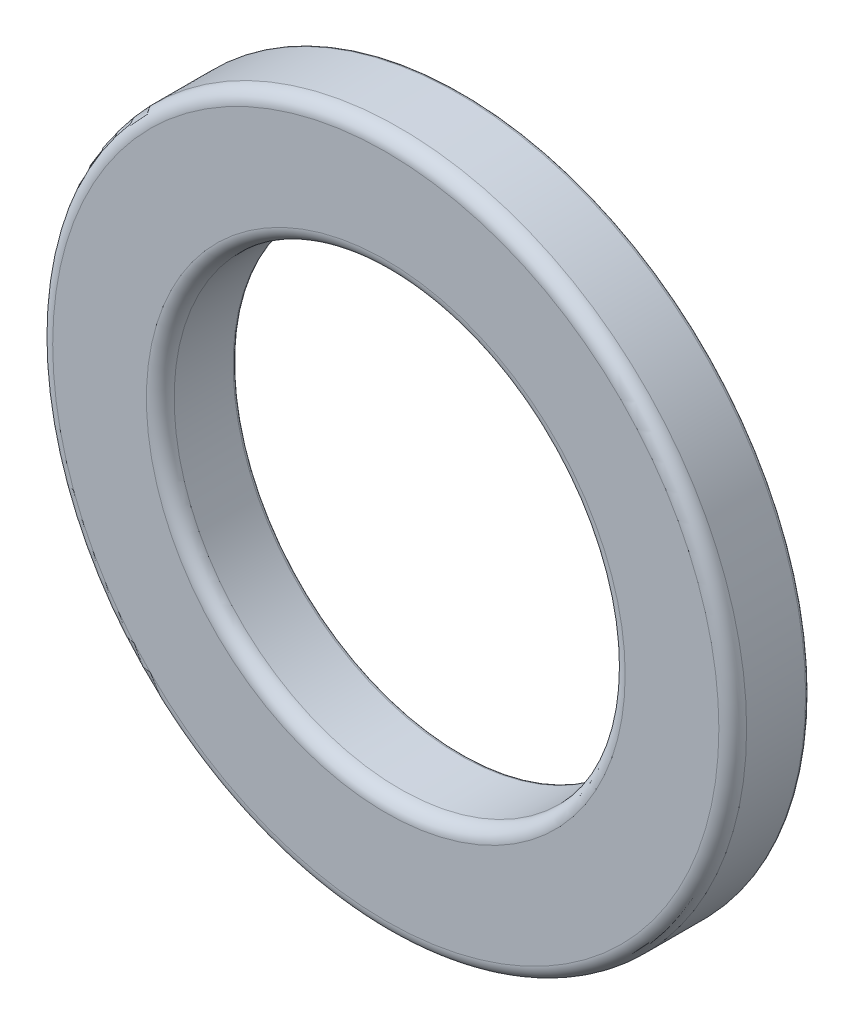
ISO-10303-21;
HEADER;
FILE_DESCRIPTION(('STEP AP214'),'2;1');
FILE_NAME('part.step','',(''),(''),'','','');
FILE_SCHEMA(('AUTOMOTIVE_DESIGN { 1 0 10303 214 1 1 1 1 }'));
ENDSEC;
DATA;
#1=APPLICATION_CONTEXT('core data for automotive mechanical design processes');
#2=APPLICATION_PROTOCOL_DEFINITION('international standard','automotive_design',2000,#1);
#3=PRODUCT_CONTEXT('',#1,'mechanical');
#4=PRODUCT('Part','Part','',(#3));
#5=PRODUCT_RELATED_PRODUCT_CATEGORY('part','',(#4));
#6=PRODUCT_DEFINITION_FORMATION('','',#4);
#7=PRODUCT_DEFINITION_CONTEXT('part definition',#1,'design');
#8=PRODUCT_DEFINITION('design','',#6,#7);
#9=PRODUCT_DEFINITION_SHAPE('','',#8);
#10=(LENGTH_UNIT() NAMED_UNIT(*) SI_UNIT(.MILLI.,.METRE.));
#11=(NAMED_UNIT(*) PLANE_ANGLE_UNIT() SI_UNIT($,.RADIAN.));
#12=(NAMED_UNIT(*) SI_UNIT($,.STERADIAN.) SOLID_ANGLE_UNIT());
#13=UNCERTAINTY_MEASURE_WITH_UNIT(LENGTH_MEASURE(1.E-05),#10,'distance_accuracy_value','');
#14=(GEOMETRIC_REPRESENTATION_CONTEXT(3) GLOBAL_UNCERTAINTY_ASSIGNED_CONTEXT((#13)) GLOBAL_UNIT_ASSIGNED_CONTEXT((#10,
#11,#12)) REPRESENTATION_CONTEXT('',''));
#15=CARTESIAN_POINT('',(0.,0.,0.));
#16=DIRECTION('',(0.,0.,1.));
#17=DIRECTION('',(1.,0.,0.));
#18=AXIS2_PLACEMENT_3D('',#15,#16,#17);
#19=CARTESIAN_POINT('',(0.,0.,-1.1));
#20=DIRECTION('',(0.,0.,1.));
#21=DIRECTION('',(1.,0.,0.));
#22=AXIS2_PLACEMENT_3D('',#19,#20,#21);
#23=CYLINDRICAL_SURFACE('',#22,10.);
#24=CARTESIAN_POINT('',(0.,0.,-1.));
#25=DIRECTION('',(0.,0.,1.));
#26=DIRECTION('',(1.,0.,0.));
#27=AXIS2_PLACEMENT_3D('',#24,#25,#26);
#28=CIRCLE('',#27,10.);
#29=CARTESIAN_POINT('',(10.,0.,-1.));
#30=VERTEX_POINT('',#29);
#31=EDGE_CURVE('E91',#30,#30,#28,.T.);
#32=ORIENTED_EDGE('',*,*,#31,.T.);
#33=EDGE_LOOP('',(#32));
#34=FACE_BOUND('',#33,.T.);
#35=CARTESIAN_POINT('',(0.,0.,0.7));
#36=DIRECTION('',(0.,0.,1.));
#37=DIRECTION('',(1.,0.,0.));
#38=AXIS2_PLACEMENT_3D('',#35,#36,#37);
#39=CIRCLE('',#38,10.);
#40=CARTESIAN_POINT('',(10.,0.,0.7));
#41=VERTEX_POINT('',#40);
#42=EDGE_CURVE('E99',#41,#41,#39,.F.);
#43=ORIENTED_EDGE('',*,*,#42,.T.);
#44=EDGE_LOOP('',(#43));
#45=FACE_BOUND('',#44,.T.);
#46=ADVANCED_FACE('F76',(#34,#45),#23,.T.);
#47=CARTESIAN_POINT('',(0.,0.,-1.1));
#48=DIRECTION('',(0.,0.,1.));
#49=DIRECTION('',(1.,0.,0.));
#50=AXIS2_PLACEMENT_3D('',#47,#48,#49);
#51=PLANE('',#50);
#52=CARTESIAN_POINT('',(0.,0.,-1.1));
#53=DIRECTION('',(0.,0.,1.));
#54=DIRECTION('',(1.,0.,0.));
#55=AXIS2_PLACEMENT_3D('',#52,#53,#54);
#56=CIRCLE('',#55,9.9);
#57=CARTESIAN_POINT('',(9.9,0.,-1.1));
#58=VERTEX_POINT('',#57);
#59=EDGE_CURVE('E83',#58,#58,#56,.F.);
#60=ORIENTED_EDGE('',*,*,#59,.T.);
#61=EDGE_LOOP('',(#60));
#62=FACE_BOUND('',#61,.T.);
#63=CARTESIAN_POINT('',(0.,0.,-1.1));
#64=DIRECTION('',(0.,0.,1.));
#65=DIRECTION('',(1.,0.,0.));
#66=AXIS2_PLACEMENT_3D('',#63,#64,#65);
#67=CIRCLE('',#66,6.6);
#68=CARTESIAN_POINT('',(6.6,0.,-1.1));
#69=VERTEX_POINT('',#68);
#70=EDGE_CURVE('E87',#69,#69,#67,.T.);
#71=ORIENTED_EDGE('',*,*,#70,.T.);
#72=EDGE_LOOP('',(#71));
#73=FACE_BOUND('',#72,.T.);
#74=ADVANCED_FACE('F121',(#62,#73),#51,.F.);
#75=CARTESIAN_POINT('',(0.,0.,-1.1));
#76=DIRECTION('',(0.,0.,1.));
#77=DIRECTION('',(1.,0.,0.));
#78=AXIS2_PLACEMENT_3D('',#75,#76,#77);
#79=CYLINDRICAL_SURFACE('',#78,6.5);
#80=CARTESIAN_POINT('',(0.,0.,-1.));
#81=DIRECTION('',(0.,0.,1.));
#82=DIRECTION('',(1.,0.,0.));
#83=AXIS2_PLACEMENT_3D('',#80,#81,#82);
#84=CIRCLE('',#83,6.5);
#85=CARTESIAN_POINT('',(6.5,0.,-1.));
#86=VERTEX_POINT('',#85);
#87=EDGE_CURVE('E11',#86,#86,#84,.F.);
#88=ORIENTED_EDGE('',*,*,#87,.T.);
#89=EDGE_LOOP('',(#88));
#90=FACE_BOUND('',#89,.T.);
#91=CARTESIAN_POINT('',(0.,0.,0.7));
#92=DIRECTION('',(0.,0.,1.));
#93=DIRECTION('',(1.,0.,0.));
#94=AXIS2_PLACEMENT_3D('',#91,#92,#93);
#95=CIRCLE('',#94,6.5);
#96=CARTESIAN_POINT('',(6.5,0.,0.7));
#97=VERTEX_POINT('',#96);
#98=EDGE_CURVE('E96',#97,#97,#95,.T.);
#99=ORIENTED_EDGE('',*,*,#98,.T.);
#100=EDGE_LOOP('',(#99));
#101=FACE_BOUND('',#100,.T.);
#102=ADVANCED_FACE('F119',(#90,#101),#79,.F.);
#103=CARTESIAN_POINT('',(0.,0.,1.1));
#104=DIRECTION('',(0.,0.,1.));
#105=DIRECTION('',(1.,0.,0.));
#106=AXIS2_PLACEMENT_3D('',#103,#104,#105);
#107=PLANE('',#106);
#108=CARTESIAN_POINT('',(0.,0.,1.1));
#109=DIRECTION('',(0.,0.,1.));
#110=DIRECTION('',(1.,0.,0.));
#111=AXIS2_PLACEMENT_3D('',#108,#109,#110);
#112=CIRCLE('',#111,9.6);
#113=CARTESIAN_POINT('',(9.6,0.,1.1));
#114=VERTEX_POINT('',#113);
#115=EDGE_CURVE('E102',#114,#114,#112,.T.);
#116=ORIENTED_EDGE('',*,*,#115,.T.);
#117=EDGE_LOOP('',(#116));
#118=FACE_BOUND('',#117,.T.);
#119=CARTESIAN_POINT('',(0.,0.,1.1));
#120=DIRECTION('',(0.,0.,1.));
#121=DIRECTION('',(1.,0.,0.));
#122=AXIS2_PLACEMENT_3D('',#119,#120,#121);
#123=CIRCLE('',#122,6.9);
#124=CARTESIAN_POINT('',(6.9,0.,1.1));
#125=VERTEX_POINT('',#124);
#126=EDGE_CURVE('E105',#125,#125,#123,.F.);
#127=ORIENTED_EDGE('',*,*,#126,.T.);
#128=EDGE_LOOP('',(#127));
#129=FACE_BOUND('',#128,.T.);
#130=ADVANCED_FACE('F109',(#118,#129),#107,.T.);
#131=CARTESIAN_POINT('',(0.,0.,0.7));
#132=DIRECTION('',(0.,0.,1.));
#133=DIRECTION('',(1.,0.,0.));
#134=AXIS2_PLACEMENT_3D('',#131,#132,#133);
#135=TOROIDAL_SURFACE('',#134,9.6,0.4);
#136=ORIENTED_EDGE('',*,*,#42,.F.);
#137=EDGE_LOOP('',(#136));
#138=FACE_BOUND('',#137,.T.);
#139=ORIENTED_EDGE('',*,*,#115,.F.);
#140=EDGE_LOOP('',(#139));
#141=FACE_BOUND('',#140,.T.);
#142=ADVANCED_FACE('F115',(#138,#141),#135,.T.);
#143=CARTESIAN_POINT('',(0.,0.,0.7));
#144=DIRECTION('',(0.,0.,1.));
#145=DIRECTION('',(1.,0.,0.));
#146=AXIS2_PLACEMENT_3D('',#143,#144,#145);
#147=TOROIDAL_SURFACE('',#146,6.9,0.4);
#148=ORIENTED_EDGE('',*,*,#126,.F.);
#149=EDGE_LOOP('',(#148));
#150=FACE_BOUND('',#149,.T.);
#151=ORIENTED_EDGE('',*,*,#98,.F.);
#152=EDGE_LOOP('',(#151));
#153=FACE_BOUND('',#152,.T.);
#154=ADVANCED_FACE('F111',(#150,#153),#147,.T.);
#155=CARTESIAN_POINT('',(0.,0.,-1.));
#156=DIRECTION('',(0.,0.,1.));
#157=DIRECTION('',(1.,0.,0.));
#158=AXIS2_PLACEMENT_3D('',#155,#156,#157);
#159=TOROIDAL_SURFACE('',#158,9.9,0.1);
#160=ORIENTED_EDGE('',*,*,#59,.F.);
#161=EDGE_LOOP('',(#160));
#162=FACE_BOUND('',#161,.T.);
#163=ORIENTED_EDGE('',*,*,#31,.F.);
#164=EDGE_LOOP('',(#163));
#165=FACE_BOUND('',#164,.T.);
#166=ADVANCED_FACE('F114',(#162,#165),#159,.T.);
#167=CARTESIAN_POINT('',(0.,0.,-1.));
#168=DIRECTION('',(0.,0.,1.));
#169=DIRECTION('',(1.,0.,0.));
#170=AXIS2_PLACEMENT_3D('',#167,#168,#169);
#171=TOROIDAL_SURFACE('',#170,6.6,0.1);
#172=ORIENTED_EDGE('',*,*,#87,.F.);
#173=EDGE_LOOP('',(#172));
#174=FACE_BOUND('',#173,.T.);
#175=ORIENTED_EDGE('',*,*,#70,.F.);
#176=EDGE_LOOP('',(#175));
#177=FACE_BOUND('',#176,.T.);
#178=ADVANCED_FACE('F78',(#174,#177),#171,.T.);
#179=CLOSED_SHELL('',(#46,#74,#102,#130,#142,#154,#166,#178));
#180=MANIFOLD_SOLID_BREP('B2',#179);
#181=ADVANCED_BREP_SHAPE_REPRESENTATION('',(#18,#180),#14);
#182=SHAPE_DEFINITION_REPRESENTATION(#9,#181);
ENDSEC;
END-ISO-10303-21;
